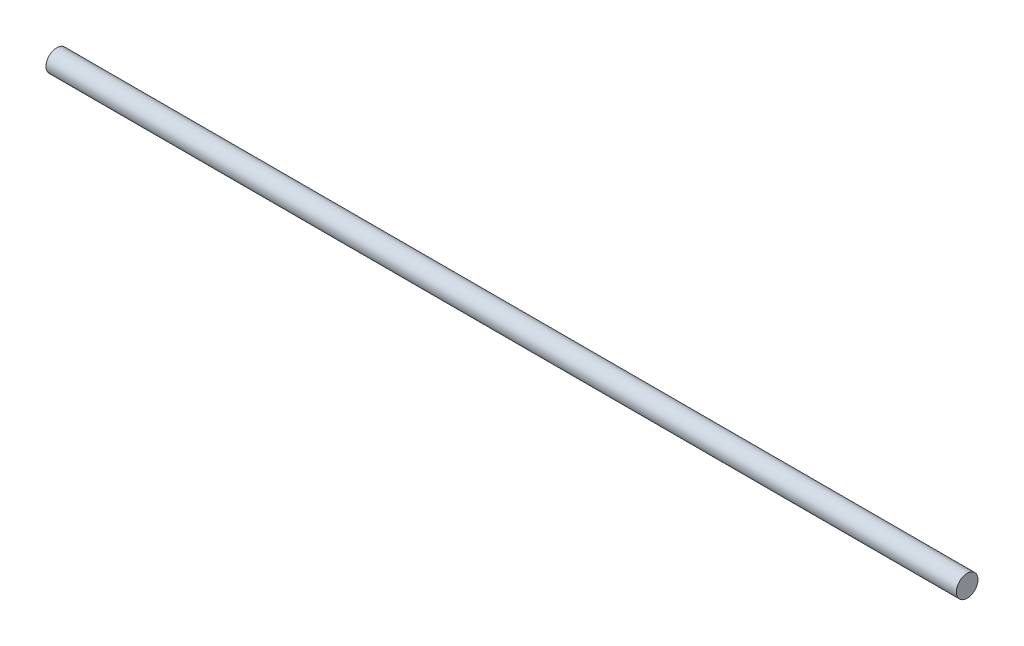
ISO-10303-21;
HEADER;
FILE_DESCRIPTION(('STEP AP214'),'2;1');
FILE_NAME('part.step','',(''),(''),'','','');
FILE_SCHEMA(('AUTOMOTIVE_DESIGN { 1 0 10303 214 1 1 1 1 }'));
ENDSEC;
DATA;
#1=APPLICATION_CONTEXT('core data for automotive mechanical design processes');
#2=APPLICATION_PROTOCOL_DEFINITION('international standard','automotive_design',2000,#1);
#3=PRODUCT_CONTEXT('',#1,'mechanical');
#4=PRODUCT('Part','Part','',(#3));
#5=PRODUCT_RELATED_PRODUCT_CATEGORY('part','',(#4));
#6=PRODUCT_DEFINITION_FORMATION('','',#4);
#7=PRODUCT_DEFINITION_CONTEXT('part definition',#1,'design');
#8=PRODUCT_DEFINITION('design','',#6,#7);
#9=PRODUCT_DEFINITION_SHAPE('','',#8);
#10=(LENGTH_UNIT() NAMED_UNIT(*) SI_UNIT(.MILLI.,.METRE.));
#11=(NAMED_UNIT(*) PLANE_ANGLE_UNIT() SI_UNIT($,.RADIAN.));
#12=(NAMED_UNIT(*) SI_UNIT($,.STERADIAN.) SOLID_ANGLE_UNIT());
#13=UNCERTAINTY_MEASURE_WITH_UNIT(LENGTH_MEASURE(1.E-05),#10,'distance_accuracy_value','');
#14=(GEOMETRIC_REPRESENTATION_CONTEXT(3) GLOBAL_UNCERTAINTY_ASSIGNED_CONTEXT((#13)) GLOBAL_UNIT_ASSIGNED_CONTEXT((#10,
#11,#12)) REPRESENTATION_CONTEXT('',''));
#15=CARTESIAN_POINT('',(0.,0.,0.));
#16=DIRECTION('',(0.,0.,1.));
#17=DIRECTION('',(1.,0.,0.));
#18=AXIS2_PLACEMENT_3D('',#15,#16,#17);
#19=CARTESIAN_POINT('',(62.9999999999999,0.75,0.));
#20=DIRECTION('',(-1.,0.,0.));
#21=DIRECTION('',(0.,0.,1.));
#22=AXIS2_PLACEMENT_3D('',#19,#20,#21);
#23=PLANE('',#22);
#24=CARTESIAN_POINT('',(62.9999999999999,-0.75,0.));
#25=DIRECTION('',(-1.,0.,0.));
#26=DIRECTION('',(0.,0.,1.));
#27=AXIS2_PLACEMENT_3D('',#24,#25,#26);
#28=CIRCLE('',#27,1.5);
#29=CARTESIAN_POINT('',(62.9999999999999,-0.75,1.5));
#30=VERTEX_POINT('',#29);
#31=EDGE_CURVE('E10',#30,#30,#28,.T.);
#32=ORIENTED_EDGE('',*,*,#31,.F.);
#33=EDGE_LOOP('',(#32));
#34=FACE_BOUND('',#33,.T.);
#35=ADVANCED_FACE('F37',(#34),#23,.F.);
#36=CARTESIAN_POINT('',(-63.0000000000001,-0.75,0.));
#37=DIRECTION('',(-1.,0.,0.));
#38=DIRECTION('',(0.,0.,1.));
#39=AXIS2_PLACEMENT_3D('',#36,#37,#38);
#40=CYLINDRICAL_SURFACE('',#39,1.5);
#41=CARTESIAN_POINT('',(-63.0000000000001,-0.75,0.));
#42=DIRECTION('',(-1.,0.,0.));
#43=DIRECTION('',(0.,0.,1.));
#44=AXIS2_PLACEMENT_3D('',#41,#42,#43);
#45=CIRCLE('',#44,1.5);
#46=CARTESIAN_POINT('',(-63.0000000000001,-0.75,1.5));
#47=VERTEX_POINT('',#46);
#48=EDGE_CURVE('E44',#47,#47,#45,.T.);
#49=ORIENTED_EDGE('',*,*,#48,.F.);
#50=EDGE_LOOP('',(#49));
#51=FACE_BOUND('',#50,.T.);
#52=ORIENTED_EDGE('',*,*,#31,.T.);
#53=EDGE_LOOP('',(#52));
#54=FACE_BOUND('',#53,.T.);
#55=ADVANCED_FACE('F53',(#51,#54),#40,.T.);
#56=CARTESIAN_POINT('',(-63.0000000000001,0.75,0.));
#57=DIRECTION('',(1.,0.,0.));
#58=DIRECTION('',(0.,0.,-1.));
#59=AXIS2_PLACEMENT_3D('',#56,#57,#58);
#60=PLANE('',#59);
#61=ORIENTED_EDGE('',*,*,#48,.T.);
#62=EDGE_LOOP('',(#61));
#63=FACE_BOUND('',#62,.T.);
#64=ADVANCED_FACE('F51',(#63),#60,.F.);
#65=CLOSED_SHELL('',(#35,#55,#64));
#66=MANIFOLD_SOLID_BREP('B2',#65);
#67=ADVANCED_BREP_SHAPE_REPRESENTATION('',(#18,#66),#14);
#68=SHAPE_DEFINITION_REPRESENTATION(#9,#67);
ENDSEC;
END-ISO-10303-21;
